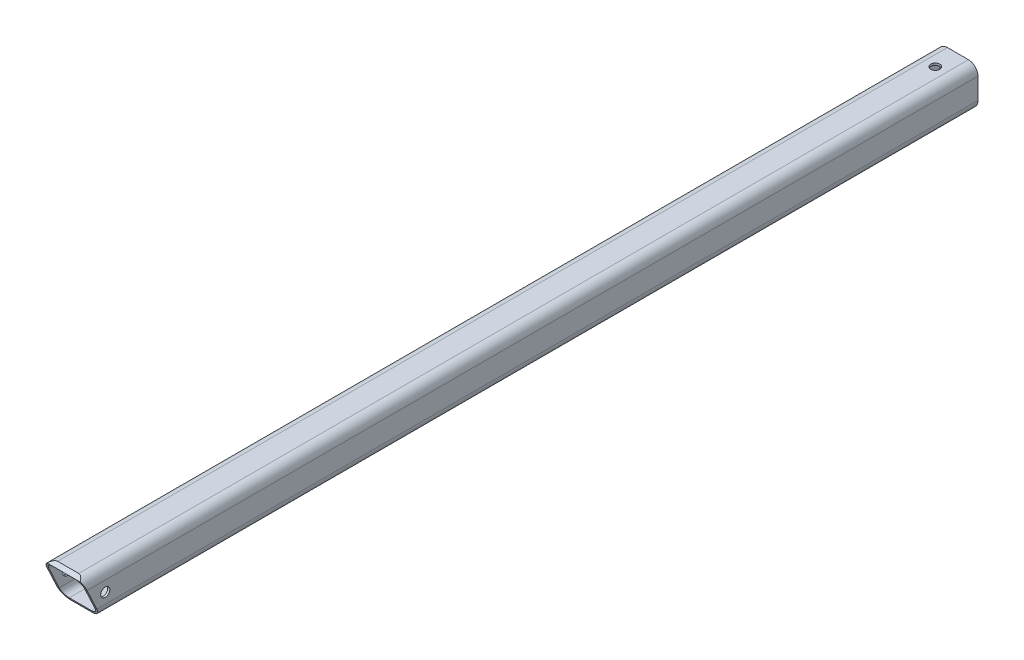
ISO-10303-21;
HEADER;
FILE_DESCRIPTION(('STEP AP214'),'2;1');
FILE_NAME('part.step','',(''),(''),'','','');
FILE_SCHEMA(('AUTOMOTIVE_DESIGN { 1 0 10303 214 1 1 1 1 }'));
ENDSEC;
DATA;
#1=APPLICATION_CONTEXT('core data for automotive mechanical design processes');
#2=APPLICATION_PROTOCOL_DEFINITION('international standard','automotive_design',2000,#1);
#3=PRODUCT_CONTEXT('',#1,'mechanical');
#4=PRODUCT('Part','Part','',(#3));
#5=PRODUCT_RELATED_PRODUCT_CATEGORY('part','',(#4));
#6=PRODUCT_DEFINITION_FORMATION('','',#4);
#7=PRODUCT_DEFINITION_CONTEXT('part definition',#1,'design');
#8=PRODUCT_DEFINITION('design','',#6,#7);
#9=PRODUCT_DEFINITION_SHAPE('','',#8);
#10=(LENGTH_UNIT() NAMED_UNIT(*) SI_UNIT(.MILLI.,.METRE.));
#11=(NAMED_UNIT(*) PLANE_ANGLE_UNIT() SI_UNIT($,.RADIAN.));
#12=(NAMED_UNIT(*) SI_UNIT($,.STERADIAN.) SOLID_ANGLE_UNIT());
#13=UNCERTAINTY_MEASURE_WITH_UNIT(LENGTH_MEASURE(1.E-05),#10,'distance_accuracy_value','');
#14=(GEOMETRIC_REPRESENTATION_CONTEXT(3) GLOBAL_UNCERTAINTY_ASSIGNED_CONTEXT((#13)) GLOBAL_UNIT_ASSIGNED_CONTEXT((#10,
#11,#12)) REPRESENTATION_CONTEXT('',''));
#15=CARTESIAN_POINT('',(0.,0.,0.));
#16=DIRECTION('',(0.,0.,1.));
#17=DIRECTION('',(1.,0.,0.));
#18=AXIS2_PLACEMENT_3D('',#15,#16,#17);
#19=CARTESIAN_POINT('',(11.2268,-11.2268,501.65));
#20=DIRECTION('',(-1.,0.,0.));
#21=DIRECTION('',(0.,0.,1.));
#22=AXIS2_PLACEMENT_3D('',#19,#20,#21);
#23=PLANE('',#22);
#24=DIRECTION('',(0.,0.,-1.));
#25=VECTOR('',#24,1.);
#26=CARTESIAN_POINT('',(11.2268,5.8928,501.65));
#27=LINE('',#26,#25);
#28=CARTESIAN_POINT('',(11.2268,5.8928,0.));
#29=VERTEX_POINT('',#28);
#30=CARTESIAN_POINT('',(11.2268,5.8928,499.162714951401));
#31=VERTEX_POINT('',#30);
#32=EDGE_CURVE('E177',#29,#31,#27,.F.);
#33=ORIENTED_EDGE('',*,*,#32,.T.);
#34=DIRECTION('',(0.,-0.906307787036653,-0.422618261740693));
#35=VECTOR('',#34,1.);
#36=CARTESIAN_POINT('',(11.2268,11.2268,501.65));
#37=LINE('',#36,#35);
#38=CARTESIAN_POINT('',(11.2268,-5.8928,493.66699941545));
#39=VERTEX_POINT('',#38);
#40=EDGE_CURVE('E202',#31,#39,#37,.T.);
#41=ORIENTED_EDGE('',*,*,#40,.T.);
#42=DIRECTION('',(0.,0.,-1.));
#43=VECTOR('',#42,1.);
#44=CARTESIAN_POINT('',(11.2268,-5.8928,501.65));
#45=LINE('',#44,#43);
#46=CARTESIAN_POINT('',(11.2268,-5.8928,0.));
#47=VERTEX_POINT('',#46);
#48=EDGE_CURVE('E173',#39,#47,#45,.T.);
#49=ORIENTED_EDGE('',*,*,#48,.T.);
#50=DIRECTION('',(0.,1.,0.));
#51=VECTOR('',#50,1.);
#52=CARTESIAN_POINT('',(11.2268,-11.2268,0.));
#53=LINE('',#52,#51);
#54=EDGE_CURVE('E255',#47,#29,#53,.T.);
#55=ORIENTED_EDGE('',*,*,#54,.T.);
#56=EDGE_LOOP('',(#33,#41,#49,#55));
#57=FACE_BOUND('',#56,.T.);
#58=CARTESIAN_POINT('',(11.2268,0.,488.95));
#59=DIRECTION('',(1.,0.,0.));
#60=DIRECTION('',(0.,0.,-1.));
#61=AXIS2_PLACEMENT_3D('',#58,#59,#60);
#62=CIRCLE('',#61,2.55269999999999);
#63=CARTESIAN_POINT('',(11.2268,0.,486.3973));
#64=VERTEX_POINT('',#63);
#65=EDGE_CURVE('E224',#64,#64,#62,.T.);
#66=ORIENTED_EDGE('',*,*,#65,.F.);
#67=EDGE_LOOP('',(#66));
#68=FACE_BOUND('',#67,.T.);
#69=ADVANCED_FACE('F34',(#57,#68),#23,.F.);
#70=CARTESIAN_POINT('',(0.,0.,0.));
#71=DIRECTION('',(0.,0.,1.));
#72=DIRECTION('',(1.,0.,0.));
#73=AXIS2_PLACEMENT_3D('',#70,#71,#72);
#74=PLANE('',#73);
#75=DIRECTION('',(1.,0.,0.));
#76=VECTOR('',#75,1.);
#77=CARTESIAN_POINT('',(11.2268,-11.2268,0.));
#78=LINE('',#77,#76);
#79=CARTESIAN_POINT('',(-5.8928,-11.2268,0.));
#80=VERTEX_POINT('',#79);
#81=CARTESIAN_POINT('',(5.8928,-11.2268,0.));
#82=VERTEX_POINT('',#81);
#83=EDGE_CURVE('E252',#80,#82,#78,.T.);
#84=ORIENTED_EDGE('',*,*,#83,.F.);
#85=CARTESIAN_POINT('',(-5.8928,-5.8928,0.));
#86=DIRECTION('',(0.,0.,1.));
#87=DIRECTION('',(1.,0.,0.));
#88=AXIS2_PLACEMENT_3D('',#85,#86,#87);
#89=CIRCLE('',#88,5.334);
#90=CARTESIAN_POINT('',(-11.2268,-5.8928,0.));
#91=VERTEX_POINT('',#90);
#92=EDGE_CURVE('E298',#80,#91,#89,.F.);
#93=ORIENTED_EDGE('',*,*,#92,.T.);
#94=DIRECTION('',(0.,-1.,0.));
#95=VECTOR('',#94,1.);
#96=CARTESIAN_POINT('',(-11.2268,-11.2268,0.));
#97=LINE('',#96,#95);
#98=CARTESIAN_POINT('',(-11.2268,5.8928,0.));
#99=VERTEX_POINT('',#98);
#100=EDGE_CURVE('E249',#99,#91,#97,.T.);
#101=ORIENTED_EDGE('',*,*,#100,.F.);
#102=CARTESIAN_POINT('',(-5.8928,5.8928,0.));
#103=DIRECTION('',(0.,0.,1.));
#104=DIRECTION('',(1.,0.,0.));
#105=AXIS2_PLACEMENT_3D('',#102,#103,#104);
#106=CIRCLE('',#105,5.334);
#107=CARTESIAN_POINT('',(-5.8928,11.2268,0.));
#108=VERTEX_POINT('',#107);
#109=EDGE_CURVE('E294',#99,#108,#106,.F.);
#110=ORIENTED_EDGE('',*,*,#109,.T.);
#111=DIRECTION('',(-1.,0.,0.));
#112=VECTOR('',#111,1.);
#113=CARTESIAN_POINT('',(11.2268,11.2268,0.));
#114=LINE('',#113,#112);
#115=CARTESIAN_POINT('',(5.8928,11.2268,0.));
#116=VERTEX_POINT('',#115);
#117=EDGE_CURVE('E258',#116,#108,#114,.T.);
#118=ORIENTED_EDGE('',*,*,#117,.F.);
#119=CARTESIAN_POINT('',(5.8928,5.8928,0.));
#120=DIRECTION('',(0.,0.,1.));
#121=DIRECTION('',(1.,0.,0.));
#122=AXIS2_PLACEMENT_3D('',#119,#120,#121);
#123=CIRCLE('',#122,5.334);
#124=EDGE_CURVE('E171',#116,#29,#123,.F.);
#125=ORIENTED_EDGE('',*,*,#124,.T.);
#126=ORIENTED_EDGE('',*,*,#54,.F.);
#127=CARTESIAN_POINT('',(5.8928,-5.8928,0.));
#128=DIRECTION('',(0.,0.,1.));
#129=DIRECTION('',(1.,0.,0.));
#130=AXIS2_PLACEMENT_3D('',#127,#128,#129);
#131=CIRCLE('',#130,5.334);
#132=EDGE_CURVE('E296',#47,#82,#131,.F.);
#133=ORIENTED_EDGE('',*,*,#132,.T.);
#134=EDGE_LOOP('',(#84,#93,#101,#110,#118,#125,#126,#133));
#135=FACE_BOUND('',#134,.T.);
#136=DIRECTION('',(-1.,0.,0.));
#137=VECTOR('',#136,1.);
#138=CARTESIAN_POINT('',(10.033,10.033,0.));
#139=LINE('',#138,#137);
#140=CARTESIAN_POINT('',(6.223,10.033,0.));
#141=VERTEX_POINT('',#140);
#142=CARTESIAN_POINT('',(-6.223,10.033,0.));
#143=VERTEX_POINT('',#142);
#144=EDGE_CURVE('E246',#141,#143,#139,.T.);
#145=ORIENTED_EDGE('',*,*,#144,.T.);
#146=CARTESIAN_POINT('',(-6.223,6.223,0.));
#147=DIRECTION('',(0.,0.,1.));
#148=DIRECTION('',(1.,0.,0.));
#149=AXIS2_PLACEMENT_3D('',#146,#147,#148);
#150=CIRCLE('',#149,3.81);
#151=CARTESIAN_POINT('',(-10.033,6.223,0.));
#152=VERTEX_POINT('',#151);
#153=EDGE_CURVE('E286',#143,#152,#150,.T.);
#154=ORIENTED_EDGE('',*,*,#153,.T.);
#155=DIRECTION('',(0.,-1.,0.));
#156=VECTOR('',#155,1.);
#157=CARTESIAN_POINT('',(-10.033,-10.033,0.));
#158=LINE('',#157,#156);
#159=CARTESIAN_POINT('',(-10.033,-6.223,0.));
#160=VERTEX_POINT('',#159);
#161=EDGE_CURVE('E237',#152,#160,#158,.T.);
#162=ORIENTED_EDGE('',*,*,#161,.T.);
#163=CARTESIAN_POINT('',(-6.223,-6.223,0.));
#164=DIRECTION('',(0.,0.,1.));
#165=DIRECTION('',(1.,0.,0.));
#166=AXIS2_PLACEMENT_3D('',#163,#164,#165);
#167=CIRCLE('',#166,3.81);
#168=CARTESIAN_POINT('',(-6.223,-10.033,0.));
#169=VERTEX_POINT('',#168);
#170=EDGE_CURVE('E280',#160,#169,#167,.T.);
#171=ORIENTED_EDGE('',*,*,#170,.T.);
#172=DIRECTION('',(1.,0.,0.));
#173=VECTOR('',#172,1.);
#174=CARTESIAN_POINT('',(10.033,-10.033,0.));
#175=LINE('',#174,#173);
#176=CARTESIAN_POINT('',(6.223,-10.033,0.));
#177=VERTEX_POINT('',#176);
#178=EDGE_CURVE('E240',#169,#177,#175,.T.);
#179=ORIENTED_EDGE('',*,*,#178,.T.);
#180=CARTESIAN_POINT('',(6.223,-6.223,0.));
#181=DIRECTION('',(0.,0.,1.));
#182=DIRECTION('',(1.,0.,0.));
#183=AXIS2_PLACEMENT_3D('',#180,#181,#182);
#184=CIRCLE('',#183,3.81);
#185=CARTESIAN_POINT('',(10.033,-6.223,0.));
#186=VERTEX_POINT('',#185);
#187=EDGE_CURVE('E282',#177,#186,#184,.T.);
#188=ORIENTED_EDGE('',*,*,#187,.T.);
#189=DIRECTION('',(0.,1.,0.));
#190=VECTOR('',#189,1.);
#191=CARTESIAN_POINT('',(10.033,-10.033,0.));
#192=LINE('',#191,#190);
#193=CARTESIAN_POINT('',(10.033,6.223,0.));
#194=VERTEX_POINT('',#193);
#195=EDGE_CURVE('E243',#186,#194,#192,.T.);
#196=ORIENTED_EDGE('',*,*,#195,.T.);
#197=CARTESIAN_POINT('',(6.223,6.223,0.));
#198=DIRECTION('',(0.,0.,1.));
#199=DIRECTION('',(1.,0.,0.));
#200=AXIS2_PLACEMENT_3D('',#197,#198,#199);
#201=CIRCLE('',#200,3.81);
#202=EDGE_CURVE('E284',#194,#141,#201,.T.);
#203=ORIENTED_EDGE('',*,*,#202,.T.);
#204=EDGE_LOOP('',(#145,#154,#162,#171,#179,#188,#196,#203));
#205=FACE_BOUND('',#204,.T.);
#206=ADVANCED_FACE('F312',(#135,#205),#74,.F.);
#207=CARTESIAN_POINT('',(-11.2268,-11.2268,501.65));
#208=DIRECTION('',(1.,0.,0.));
#209=DIRECTION('',(0.,0.,-1.));
#210=AXIS2_PLACEMENT_3D('',#207,#208,#209);
#211=PLANE('',#210);
#212=CARTESIAN_POINT('',(-11.2268,0.,488.95));
#213=DIRECTION('',(1.,0.,0.));
#214=DIRECTION('',(0.,0.,-1.));
#215=AXIS2_PLACEMENT_3D('',#212,#213,#214);
#216=CIRCLE('',#215,2.55269999999999);
#217=CARTESIAN_POINT('',(-11.2268,0.,486.3973));
#218=VERTEX_POINT('',#217);
#219=EDGE_CURVE('E184',#218,#218,#216,.T.);
#220=ORIENTED_EDGE('',*,*,#219,.T.);
#221=EDGE_LOOP('',(#220));
#222=FACE_BOUND('',#221,.T.);
#223=DIRECTION('',(0.,0.,-1.));
#224=VECTOR('',#223,1.);
#225=CARTESIAN_POINT('',(-11.2268,-5.8928,501.65));
#226=LINE('',#225,#224);
#227=CARTESIAN_POINT('',(-11.2268,-5.8928,493.66699941545));
#228=VERTEX_POINT('',#227);
#229=EDGE_CURVE('E301',#91,#228,#226,.F.);
#230=ORIENTED_EDGE('',*,*,#229,.T.);
#231=DIRECTION('',(0.,-0.906307787036653,-0.422618261740693));
#232=VECTOR('',#231,1.);
#233=CARTESIAN_POINT('',(-11.2268,11.2268,501.65));
#234=LINE('',#233,#232);
#235=CARTESIAN_POINT('',(-11.2268,5.8928,499.162714951401));
#236=VERTEX_POINT('',#235);
#237=EDGE_CURVE('E324',#236,#228,#234,.T.);
#238=ORIENTED_EDGE('',*,*,#237,.F.);
#239=DIRECTION('',(0.,0.,-1.));
#240=VECTOR('',#239,1.);
#241=CARTESIAN_POINT('',(-11.2268,5.8928,501.65));
#242=LINE('',#241,#240);
#243=EDGE_CURVE('E195',#236,#99,#242,.T.);
#244=ORIENTED_EDGE('',*,*,#243,.T.);
#245=ORIENTED_EDGE('',*,*,#100,.T.);
#246=EDGE_LOOP('',(#230,#238,#244,#245));
#247=FACE_BOUND('',#246,.T.);
#248=ADVANCED_FACE('F318',(#222,#247),#211,.F.);
#249=CARTESIAN_POINT('',(11.2268,-11.2268,501.65));
#250=DIRECTION('',(0.,1.,0.));
#251=DIRECTION('',(-1.,0.,0.));
#252=AXIS2_PLACEMENT_3D('',#249,#250,#251);
#253=PLANE('',#252);
#254=DIRECTION('',(0.,0.,-1.));
#255=VECTOR('',#254,1.);
#256=CARTESIAN_POINT('',(5.8928,-11.2268,501.65));
#257=LINE('',#256,#255);
#258=CARTESIAN_POINT('',(5.8928,-11.2268,491.179714366851));
#259=VERTEX_POINT('',#258);
#260=EDGE_CURVE('E288',#82,#259,#257,.F.);
#261=ORIENTED_EDGE('',*,*,#260,.T.);
#262=DIRECTION('',(-1.,0.,0.));
#263=VECTOR('',#262,1.);
#264=CARTESIAN_POINT('',(11.2268,-11.2268,491.179714366851));
#265=LINE('',#264,#263);
#266=CARTESIAN_POINT('',(-5.8928,-11.2268,491.179714366851));
#267=VERTEX_POINT('',#266);
#268=EDGE_CURVE('E197',#259,#267,#265,.T.);
#269=ORIENTED_EDGE('',*,*,#268,.T.);
#270=DIRECTION('',(0.,0.,-1.));
#271=VECTOR('',#270,1.);
#272=CARTESIAN_POINT('',(-5.8928,-11.2268,501.65));
#273=LINE('',#272,#271);
#274=EDGE_CURVE('E291',#267,#80,#273,.T.);
#275=ORIENTED_EDGE('',*,*,#274,.T.);
#276=ORIENTED_EDGE('',*,*,#83,.T.);
#277=EDGE_LOOP('',(#261,#269,#275,#276));
#278=FACE_BOUND('',#277,.T.);
#279=ADVANCED_FACE('F326',(#278),#253,.F.);
#280=CARTESIAN_POINT('',(11.2268,11.2268,501.65));
#281=DIRECTION('',(0.,-1.,0.));
#282=DIRECTION('',(0.,0.,-1.));
#283=AXIS2_PLACEMENT_3D('',#280,#281,#282);
#284=PLANE('',#283);
#285=CARTESIAN_POINT('',(0.,11.2268,12.7));
#286=DIRECTION('',(0.,1.,0.));
#287=DIRECTION('',(0.,0.,1.));
#288=AXIS2_PLACEMENT_3D('',#285,#286,#287);
#289=CIRCLE('',#288,2.5527);
#290=CARTESIAN_POINT('',(0.,11.2268,15.2527));
#291=VERTEX_POINT('',#290);
#292=EDGE_CURVE('E231',#291,#291,#289,.T.);
#293=ORIENTED_EDGE('',*,*,#292,.F.);
#294=EDGE_LOOP('',(#293));
#295=FACE_BOUND('',#294,.T.);
#296=DIRECTION('',(0.,0.,-1.));
#297=VECTOR('',#296,1.);
#298=CARTESIAN_POINT('',(-5.8928,11.2268,501.65));
#299=LINE('',#298,#297);
#300=CARTESIAN_POINT('',(-5.8928,11.2268,498.53320955599));
#301=VERTEX_POINT('',#300);
#302=EDGE_CURVE('E168',#108,#301,#299,.F.);
#303=ORIENTED_EDGE('',*,*,#302,.T.);
#304=DIRECTION('',(-1.,0.,0.));
#305=VECTOR('',#304,1.);
#306=CARTESIAN_POINT('',(11.2268,11.2268,498.53320955599));
#307=LINE('',#306,#305);
#308=CARTESIAN_POINT('',(5.8928,11.2268,498.53320955599));
#309=VERTEX_POINT('',#308);
#310=EDGE_CURVE('E155',#309,#301,#307,.T.);
#311=ORIENTED_EDGE('',*,*,#310,.F.);
#312=DIRECTION('',(0.,0.,-1.));
#313=VECTOR('',#312,1.);
#314=CARTESIAN_POINT('',(5.8928,11.2268,501.65));
#315=LINE('',#314,#313);
#316=EDGE_CURVE('E165',#309,#116,#315,.T.);
#317=ORIENTED_EDGE('',*,*,#316,.T.);
#318=ORIENTED_EDGE('',*,*,#117,.T.);
#319=EDGE_LOOP('',(#303,#311,#317,#318));
#320=FACE_BOUND('',#319,.T.);
#321=ADVANCED_FACE('F163',(#295,#320),#284,.F.);
#322=CARTESIAN_POINT('',(-10.033,-10.033,501.65));
#323=DIRECTION('',(1.,0.,0.));
#324=DIRECTION('',(0.,0.,-1.));
#325=AXIS2_PLACEMENT_3D('',#322,#323,#324);
#326=PLANE('',#325);
#327=DIRECTION('',(0.,0.906307787036653,0.422618261740693));
#328=VECTOR('',#327,1.);
#329=CARTESIAN_POINT('',(-10.033,-6.23586801220705,493.50702417409));
#330=LINE('',#329,#328);
#331=CARTESIAN_POINT('',(-10.033,-6.223,493.513024626727));
#332=VERTEX_POINT('',#331);
#333=CARTESIAN_POINT('',(-10.033,6.223,499.316689740124));
#334=VERTEX_POINT('',#333);
#335=EDGE_CURVE('E57',#332,#334,#330,.T.);
#336=ORIENTED_EDGE('',*,*,#335,.F.);
#337=DIRECTION('',(0.,0.,-1.));
#338=VECTOR('',#337,1.);
#339=CARTESIAN_POINT('',(-10.033,-6.223,0.));
#340=LINE('',#339,#338);
#341=EDGE_CURVE('E263',#332,#160,#340,.T.);
#342=ORIENTED_EDGE('',*,*,#341,.T.);
#343=ORIENTED_EDGE('',*,*,#161,.F.);
#344=DIRECTION('',(0.,0.,-1.));
#345=VECTOR('',#344,1.);
#346=CARTESIAN_POINT('',(-10.033,6.223,501.65));
#347=LINE('',#346,#345);
#348=EDGE_CURVE('E260',#152,#334,#347,.F.);
#349=ORIENTED_EDGE('',*,*,#348,.T.);
#350=EDGE_LOOP('',(#336,#342,#343,#349));
#351=FACE_BOUND('',#350,.T.);
#352=CARTESIAN_POINT('',(-10.033,0.,488.95));
#353=DIRECTION('',(1.,0.,0.));
#354=DIRECTION('',(0.,0.,-1.));
#355=AXIS2_PLACEMENT_3D('',#352,#353,#354);
#356=CIRCLE('',#355,2.55269999999999);
#357=CARTESIAN_POINT('',(-10.033,0.,486.3973));
#358=VERTEX_POINT('',#357);
#359=EDGE_CURVE('E183',#358,#358,#356,.T.);
#360=ORIENTED_EDGE('',*,*,#359,.F.);
#361=EDGE_LOOP('',(#360));
#362=FACE_BOUND('',#361,.T.);
#363=ADVANCED_FACE('F396',(#351,#362),#326,.T.);
#364=CARTESIAN_POINT('',(10.033,-10.033,501.65));
#365=DIRECTION('',(0.,1.,0.));
#366=DIRECTION('',(0.,0.,1.));
#367=AXIS2_PLACEMENT_3D('',#364,#365,#366);
#368=PLANE('',#367);
#369=DIRECTION('',(-1.,0.,0.));
#370=VECTOR('',#369,1.);
#371=CARTESIAN_POINT('',(10.033,-10.033,491.736392449157));
#372=LINE('',#371,#370);
#373=CARTESIAN_POINT('',(6.223,-10.033,491.736392449157));
#374=VERTEX_POINT('',#373);
#375=CARTESIAN_POINT('',(-6.223,-10.033,491.736392449157));
#376=VERTEX_POINT('',#375);
#377=EDGE_CURVE('E219',#374,#376,#372,.T.);
#378=ORIENTED_EDGE('',*,*,#377,.F.);
#379=DIRECTION('',(0.,0.,-1.));
#380=VECTOR('',#379,1.);
#381=CARTESIAN_POINT('',(6.223,-10.033,0.));
#382=LINE('',#381,#380);
#383=EDGE_CURVE('E265',#374,#177,#382,.T.);
#384=ORIENTED_EDGE('',*,*,#383,.T.);
#385=ORIENTED_EDGE('',*,*,#178,.F.);
#386=DIRECTION('',(0.,0.,-1.));
#387=VECTOR('',#386,1.);
#388=CARTESIAN_POINT('',(-6.223,-10.033,501.65));
#389=LINE('',#388,#387);
#390=EDGE_CURVE('E267',#169,#376,#389,.F.);
#391=ORIENTED_EDGE('',*,*,#390,.T.);
#392=EDGE_LOOP('',(#378,#384,#385,#391));
#393=FACE_BOUND('',#392,.T.);
#394=ADVANCED_FACE('F390',(#393),#368,.T.);
#395=CARTESIAN_POINT('',(10.033,-10.033,501.65));
#396=DIRECTION('',(-1.,0.,0.));
#397=DIRECTION('',(0.,0.,1.));
#398=AXIS2_PLACEMENT_3D('',#395,#396,#397);
#399=PLANE('',#398);
#400=DIRECTION('',(0.,-0.906307787036653,-0.422618261740693));
#401=VECTOR('',#400,1.);
#402=CARTESIAN_POINT('',(10.033,-6.23586801220705,493.50702417409));
#403=LINE('',#402,#401);
#404=CARTESIAN_POINT('',(10.033,6.223,499.316689740124));
#405=VERTEX_POINT('',#404);
#406=CARTESIAN_POINT('',(10.033,-6.223,493.513024626727));
#407=VERTEX_POINT('',#406);
#408=EDGE_CURVE('E217',#405,#407,#403,.T.);
#409=ORIENTED_EDGE('',*,*,#408,.F.);
#410=DIRECTION('',(0.,0.,-1.));
#411=VECTOR('',#410,1.);
#412=CARTESIAN_POINT('',(10.033,6.223,0.));
#413=LINE('',#412,#411);
#414=EDGE_CURVE('E270',#405,#194,#413,.T.);
#415=ORIENTED_EDGE('',*,*,#414,.T.);
#416=ORIENTED_EDGE('',*,*,#195,.F.);
#417=DIRECTION('',(0.,0.,-1.));
#418=VECTOR('',#417,1.);
#419=CARTESIAN_POINT('',(10.033,-6.223,501.65));
#420=LINE('',#419,#418);
#421=EDGE_CURVE('E272',#186,#407,#420,.F.);
#422=ORIENTED_EDGE('',*,*,#421,.T.);
#423=EDGE_LOOP('',(#409,#415,#416,#422));
#424=FACE_BOUND('',#423,.T.);
#425=CARTESIAN_POINT('',(10.033,0.,488.95));
#426=DIRECTION('',(-1.,0.,0.));
#427=DIRECTION('',(0.,0.,1.));
#428=AXIS2_PLACEMENT_3D('',#425,#426,#427);
#429=CIRCLE('',#428,2.55269999999999);
#430=CARTESIAN_POINT('',(10.033,0.,491.5027));
#431=VERTEX_POINT('',#430);
#432=EDGE_CURVE('E181',#431,#431,#429,.T.);
#433=ORIENTED_EDGE('',*,*,#432,.F.);
#434=EDGE_LOOP('',(#433));
#435=FACE_BOUND('',#434,.T.);
#436=ADVANCED_FACE('F382',(#424,#435),#399,.T.);
#437=CARTESIAN_POINT('',(10.033,10.033,501.65));
#438=DIRECTION('',(0.,-1.,0.));
#439=DIRECTION('',(0.,0.,-1.));
#440=AXIS2_PLACEMENT_3D('',#437,#438,#439);
#441=PLANE('',#440);
#442=DIRECTION('',(1.,0.,0.));
#443=VECTOR('',#442,1.);
#444=CARTESIAN_POINT('',(10.033,10.033,501.093321917695));
#445=LINE('',#444,#443);
#446=CARTESIAN_POINT('',(-6.223,10.033,501.093321917695));
#447=VERTEX_POINT('',#446);
#448=CARTESIAN_POINT('',(6.223,10.033,501.093321917695));
#449=VERTEX_POINT('',#448);
#450=EDGE_CURVE('E208',#447,#449,#445,.T.);
#451=ORIENTED_EDGE('',*,*,#450,.F.);
#452=DIRECTION('',(0.,0.,-1.));
#453=VECTOR('',#452,1.);
#454=CARTESIAN_POINT('',(-6.223,10.033,0.));
#455=LINE('',#454,#453);
#456=EDGE_CURVE('E275',#447,#143,#455,.T.);
#457=ORIENTED_EDGE('',*,*,#456,.T.);
#458=ORIENTED_EDGE('',*,*,#144,.F.);
#459=DIRECTION('',(0.,0.,-1.));
#460=VECTOR('',#459,1.);
#461=CARTESIAN_POINT('',(6.223,10.033,501.65));
#462=LINE('',#461,#460);
#463=EDGE_CURVE('E277',#141,#449,#462,.F.);
#464=ORIENTED_EDGE('',*,*,#463,.T.);
#465=EDGE_LOOP('',(#451,#457,#458,#464));
#466=FACE_BOUND('',#465,.T.);
#467=CARTESIAN_POINT('',(0.,10.033,12.7));
#468=DIRECTION('',(0.,-1.,0.));
#469=DIRECTION('',(0.,0.,-1.));
#470=AXIS2_PLACEMENT_3D('',#467,#468,#469);
#471=CIRCLE('',#470,2.5527);
#472=CARTESIAN_POINT('',(0.,10.033,10.1473));
#473=VERTEX_POINT('',#472);
#474=EDGE_CURVE('E234',#473,#473,#471,.T.);
#475=ORIENTED_EDGE('',*,*,#474,.F.);
#476=EDGE_LOOP('',(#475));
#477=FACE_BOUND('',#476,.T.);
#478=ADVANCED_FACE('F357',(#466,#477),#441,.T.);
#479=CARTESIAN_POINT('',(-6.223,-6.223,501.65));
#480=DIRECTION('',(0.,0.,1.));
#481=DIRECTION('',(1.,0.,0.));
#482=AXIS2_PLACEMENT_3D('',#479,#480,#481);
#483=CYLINDRICAL_SURFACE('',#482,3.81);
#484=ORIENTED_EDGE('',*,*,#341,.F.);
#485=CARTESIAN_POINT('',(-6.223,-6.223,493.513024626727));
#486=DIRECTION('',(0.,0.422618261740693,-0.906307787036653));
#487=DIRECTION('',(0.,0.906307787036653,0.422618261740693));
#488=AXIS2_PLACEMENT_3D('',#485,#486,#487);
#489=ELLIPSE('',#488,4.20386987124708,3.81);
#490=EDGE_CURVE('E214',#332,#376,#489,.F.);
#491=ORIENTED_EDGE('',*,*,#490,.T.);
#492=ORIENTED_EDGE('',*,*,#390,.F.);
#493=ORIENTED_EDGE('',*,*,#170,.F.);
#494=EDGE_LOOP('',(#484,#491,#492,#493));
#495=FACE_BOUND('',#494,.T.);
#496=ADVANCED_FACE('F353',(#495),#483,.F.);
#497=CARTESIAN_POINT('',(6.223,-6.223,501.65));
#498=DIRECTION('',(0.,0.,1.));
#499=DIRECTION('',(1.,0.,0.));
#500=AXIS2_PLACEMENT_3D('',#497,#498,#499);
#501=CYLINDRICAL_SURFACE('',#500,3.81);
#502=ORIENTED_EDGE('',*,*,#383,.F.);
#503=CARTESIAN_POINT('',(6.223,-6.223,493.513024626727));
#504=DIRECTION('',(0.,0.422618261740693,-0.906307787036653));
#505=DIRECTION('',(0.,0.906307787036653,0.422618261740693));
#506=AXIS2_PLACEMENT_3D('',#503,#504,#505);
#507=ELLIPSE('',#506,4.20386987124708,3.81);
#508=EDGE_CURVE('E221',#374,#407,#507,.F.);
#509=ORIENTED_EDGE('',*,*,#508,.T.);
#510=ORIENTED_EDGE('',*,*,#421,.F.);
#511=ORIENTED_EDGE('',*,*,#187,.F.);
#512=EDGE_LOOP('',(#502,#509,#510,#511));
#513=FACE_BOUND('',#512,.T.);
#514=ADVANCED_FACE('F356',(#513),#501,.F.);
#515=CARTESIAN_POINT('',(6.223,6.223,501.65));
#516=DIRECTION('',(0.,0.,1.));
#517=DIRECTION('',(1.,0.,0.));
#518=AXIS2_PLACEMENT_3D('',#515,#516,#517);
#519=CYLINDRICAL_SURFACE('',#518,3.81);
#520=ORIENTED_EDGE('',*,*,#414,.F.);
#521=CARTESIAN_POINT('',(6.223,6.223,499.316689740124));
#522=DIRECTION('',(0.,0.422618261740693,-0.906307787036653));
#523=DIRECTION('',(0.,0.906307787036653,0.422618261740693));
#524=AXIS2_PLACEMENT_3D('',#521,#522,#523);
#525=ELLIPSE('',#524,4.20386987124708,3.81);
#526=EDGE_CURVE('E211',#405,#449,#525,.F.);
#527=ORIENTED_EDGE('',*,*,#526,.T.);
#528=ORIENTED_EDGE('',*,*,#463,.F.);
#529=ORIENTED_EDGE('',*,*,#202,.F.);
#530=EDGE_LOOP('',(#520,#527,#528,#529));
#531=FACE_BOUND('',#530,.T.);
#532=ADVANCED_FACE('F361',(#531),#519,.F.);
#533=CARTESIAN_POINT('',(-6.223,6.223,501.65));
#534=DIRECTION('',(0.,0.,1.));
#535=DIRECTION('',(1.,0.,0.));
#536=AXIS2_PLACEMENT_3D('',#533,#534,#535);
#537=CYLINDRICAL_SURFACE('',#536,3.81);
#538=ORIENTED_EDGE('',*,*,#456,.F.);
#539=CARTESIAN_POINT('',(-6.223,6.223,499.316689740124));
#540=DIRECTION('',(0.,0.422618261740693,-0.906307787036653));
#541=DIRECTION('',(0.,0.906307787036653,0.422618261740693));
#542=AXIS2_PLACEMENT_3D('',#539,#540,#541);
#543=ELLIPSE('',#542,4.20386987124708,3.81);
#544=EDGE_CURVE('E189',#447,#334,#543,.F.);
#545=ORIENTED_EDGE('',*,*,#544,.T.);
#546=ORIENTED_EDGE('',*,*,#348,.F.);
#547=ORIENTED_EDGE('',*,*,#153,.F.);
#548=EDGE_LOOP('',(#538,#545,#546,#547));
#549=FACE_BOUND('',#548,.T.);
#550=ADVANCED_FACE('F338',(#549),#537,.F.);
#551=CARTESIAN_POINT('',(-5.8928,-5.8928,501.65));
#552=DIRECTION('',(0.,0.,-1.));
#553=DIRECTION('',(-1.,0.,0.));
#554=AXIS2_PLACEMENT_3D('',#551,#552,#553);
#555=CYLINDRICAL_SURFACE('',#554,5.334);
#556=CARTESIAN_POINT('',(-5.8928,-5.8928,493.66699941545));
#557=DIRECTION('',(0.,0.422618261740693,-0.906307787036653));
#558=DIRECTION('',(0.,-0.906307787036653,-0.422618261740693));
#559=AXIS2_PLACEMENT_3D('',#556,#557,#558);
#560=ELLIPSE('',#559,5.88541781974591,5.334);
#561=EDGE_CURVE('E199',#228,#267,#560,.F.);
#562=ORIENTED_EDGE('',*,*,#561,.F.);
#563=ORIENTED_EDGE('',*,*,#229,.F.);
#564=ORIENTED_EDGE('',*,*,#92,.F.);
#565=ORIENTED_EDGE('',*,*,#274,.F.);
#566=EDGE_LOOP('',(#562,#563,#564,#565));
#567=FACE_BOUND('',#566,.T.);
#568=ADVANCED_FACE('F321',(#567),#555,.T.);
#569=CARTESIAN_POINT('',(5.8928,-5.8928,501.65));
#570=DIRECTION('',(0.,0.,-1.));
#571=DIRECTION('',(-1.,0.,0.));
#572=AXIS2_PLACEMENT_3D('',#569,#570,#571);
#573=CYLINDRICAL_SURFACE('',#572,5.334);
#574=CARTESIAN_POINT('',(5.8928,-5.8928,493.66699941545));
#575=DIRECTION('',(0.,0.422618261740693,-0.906307787036653));
#576=DIRECTION('',(0.,-0.906307787036653,-0.422618261740693));
#577=AXIS2_PLACEMENT_3D('',#574,#575,#576);
#578=ELLIPSE('',#577,5.88541781974591,5.334);
#579=EDGE_CURVE('E196',#259,#39,#578,.F.);
#580=ORIENTED_EDGE('',*,*,#579,.F.);
#581=ORIENTED_EDGE('',*,*,#260,.F.);
#582=ORIENTED_EDGE('',*,*,#132,.F.);
#583=ORIENTED_EDGE('',*,*,#48,.F.);
#584=EDGE_LOOP('',(#580,#581,#582,#583));
#585=FACE_BOUND('',#584,.T.);
#586=ADVANCED_FACE('F329',(#585),#573,.T.);
#587=CARTESIAN_POINT('',(-5.8928,5.8928,501.65));
#588=DIRECTION('',(0.,0.,-1.));
#589=DIRECTION('',(-1.,0.,0.));
#590=AXIS2_PLACEMENT_3D('',#587,#588,#589);
#591=CYLINDRICAL_SURFACE('',#590,5.334);
#592=CARTESIAN_POINT('',(-5.8928,5.8928,509.972009469989));
#593=DIRECTION('',(0.,-0.906307787036658,-0.422618261740682));
#594=DIRECTION('',(0.,0.422618261740682,-0.906307787036658));
#595=AXIS2_PLACEMENT_3D('',#592,#593,#594);
#596=ELLIPSE('',#595,12.6213192445359,5.334);
#597=CARTESIAN_POINT('',(-9.25587894049484,10.033,501.093321917695));
#598=VERTEX_POINT('',#597);
#599=EDGE_CURVE('E49',#301,#598,#596,.F.);
#600=ORIENTED_EDGE('',*,*,#599,.F.);
#601=ORIENTED_EDGE('',*,*,#302,.F.);
#602=ORIENTED_EDGE('',*,*,#109,.F.);
#603=ORIENTED_EDGE('',*,*,#243,.F.);
#604=CARTESIAN_POINT('',(-5.8928,5.8928,499.162714951401));
#605=DIRECTION('',(0.,0.422618261740693,-0.906307787036653));
#606=DIRECTION('',(0.,-0.906307787036653,-0.422618261740693));
#607=AXIS2_PLACEMENT_3D('',#604,#605,#606);
#608=ELLIPSE('',#607,5.88541781974591,5.334);
#609=EDGE_CURVE('E187',#598,#236,#608,.F.);
#610=ORIENTED_EDGE('',*,*,#609,.F.);
#611=EDGE_LOOP('',(#600,#601,#602,#603,#610));
#612=FACE_BOUND('',#611,.T.);
#613=ADVANCED_FACE('F193',(#612),#591,.T.);
#614=CARTESIAN_POINT('',(5.8928,5.8928,501.65));
#615=DIRECTION('',(0.,0.,-1.));
#616=DIRECTION('',(-1.,0.,0.));
#617=AXIS2_PLACEMENT_3D('',#614,#615,#616);
#618=CYLINDRICAL_SURFACE('',#617,5.334);
#619=CARTESIAN_POINT('',(5.8928,5.8928,509.972009469989));
#620=DIRECTION('',(0.,-0.906307787036658,-0.422618261740682));
#621=DIRECTION('',(0.,0.422618261740682,-0.906307787036658));
#622=AXIS2_PLACEMENT_3D('',#619,#620,#621);
#623=ELLIPSE('',#622,12.6213192445359,5.334);
#624=CARTESIAN_POINT('',(9.25587894049484,10.033,501.093321917695));
#625=VERTEX_POINT('',#624);
#626=EDGE_CURVE('E152',#625,#309,#623,.F.);
#627=ORIENTED_EDGE('',*,*,#626,.F.);
#628=CARTESIAN_POINT('',(5.8928,5.8928,499.162714951401));
#629=DIRECTION('',(0.,0.422618261740693,-0.906307787036653));
#630=DIRECTION('',(0.,-0.906307787036653,-0.422618261740693));
#631=AXIS2_PLACEMENT_3D('',#628,#629,#630);
#632=ELLIPSE('',#631,5.88541781974591,5.334);
#633=EDGE_CURVE('E175',#31,#625,#632,.F.);
#634=ORIENTED_EDGE('',*,*,#633,.F.);
#635=ORIENTED_EDGE('',*,*,#32,.F.);
#636=ORIENTED_EDGE('',*,*,#124,.F.);
#637=ORIENTED_EDGE('',*,*,#316,.F.);
#638=EDGE_LOOP('',(#627,#634,#635,#636,#637));
#639=FACE_BOUND('',#638,.T.);
#640=ADVANCED_FACE('F36',(#639),#618,.T.);
#641=CARTESIAN_POINT('',(0.,11.2268,12.7));
#642=DIRECTION('',(0.,1.,0.));
#643=DIRECTION('',(0.,0.,1.));
#644=AXIS2_PLACEMENT_3D('',#641,#642,#643);
#645=CYLINDRICAL_SURFACE('',#644,2.5527);
#646=ORIENTED_EDGE('',*,*,#474,.T.);
#647=EDGE_LOOP('',(#646));
#648=FACE_BOUND('',#647,.T.);
#649=ORIENTED_EDGE('',*,*,#292,.T.);
#650=EDGE_LOOP('',(#649));
#651=FACE_BOUND('',#650,.T.);
#652=ADVANCED_FACE('F413',(#648,#651),#645,.F.);
#653=CARTESIAN_POINT('',(11.2268,0.,488.95));
#654=DIRECTION('',(1.,0.,0.));
#655=DIRECTION('',(0.,0.,-1.));
#656=AXIS2_PLACEMENT_3D('',#653,#654,#655);
#657=CYLINDRICAL_SURFACE('',#656,2.55269999999999);
#658=ORIENTED_EDGE('',*,*,#432,.T.);
#659=EDGE_LOOP('',(#658));
#660=FACE_BOUND('',#659,.T.);
#661=ORIENTED_EDGE('',*,*,#65,.T.);
#662=EDGE_LOOP('',(#661));
#663=FACE_BOUND('',#662,.T.);
#664=ADVANCED_FACE('F405',(#660,#663),#657,.F.);
#665=ORIENTED_EDGE('',*,*,#359,.T.);
#666=EDGE_LOOP('',(#665));
#667=FACE_BOUND('',#666,.T.);
#668=ORIENTED_EDGE('',*,*,#219,.F.);
#669=EDGE_LOOP('',(#668));
#670=FACE_BOUND('',#669,.T.);
#671=ADVANCED_FACE('F402',(#667,#670),#657,.F.);
#672=CARTESIAN_POINT('',(11.2268,11.2268,501.65));
#673=DIRECTION('',(0.,0.422618261740693,-0.906307787036653));
#674=DIRECTION('',(0.,0.906307787036653,0.422618261740693));
#675=AXIS2_PLACEMENT_3D('',#672,#673,#674);
#676=PLANE('',#675);
#677=ORIENTED_EDGE('',*,*,#633,.T.);
#678=DIRECTION('',(-1.,0.,0.));
#679=VECTOR('',#678,1.);
#680=CARTESIAN_POINT('',(11.2268,10.033,501.093321917695));
#681=LINE('',#680,#679);
#682=EDGE_CURVE('E11',#625,#449,#681,.T.);
#683=ORIENTED_EDGE('',*,*,#682,.T.);
#684=ORIENTED_EDGE('',*,*,#526,.F.);
#685=ORIENTED_EDGE('',*,*,#408,.T.);
#686=ORIENTED_EDGE('',*,*,#508,.F.);
#687=ORIENTED_EDGE('',*,*,#377,.T.);
#688=ORIENTED_EDGE('',*,*,#490,.F.);
#689=ORIENTED_EDGE('',*,*,#335,.T.);
#690=ORIENTED_EDGE('',*,*,#544,.F.);
#691=EDGE_CURVE('E38',#447,#598,#681,.T.);
#692=ORIENTED_EDGE('',*,*,#691,.T.);
#693=ORIENTED_EDGE('',*,*,#609,.T.);
#694=ORIENTED_EDGE('',*,*,#237,.T.);
#695=ORIENTED_EDGE('',*,*,#561,.T.);
#696=ORIENTED_EDGE('',*,*,#268,.F.);
#697=ORIENTED_EDGE('',*,*,#579,.T.);
#698=ORIENTED_EDGE('',*,*,#40,.F.);
#699=EDGE_LOOP('',(#677,#683,#684,#685,#686,#687,#688,#689,#690,#692,#693,#694,#695,#696,#697,#698));
#700=FACE_BOUND('',#699,.T.);
#701=ADVANCED_FACE('F186',(#700),#676,.F.);
#702=CARTESIAN_POINT('',(11.2268,10.033,501.093321917695));
#703=DIRECTION('',(0.,-0.906307787036658,-0.422618261740682));
#704=DIRECTION('',(0.,0.422618261740682,-0.906307787036658));
#705=AXIS2_PLACEMENT_3D('',#702,#703,#704);
#706=PLANE('',#705);
#707=ORIENTED_EDGE('',*,*,#599,.T.);
#708=ORIENTED_EDGE('',*,*,#691,.F.);
#709=ORIENTED_EDGE('',*,*,#450,.T.);
#710=ORIENTED_EDGE('',*,*,#682,.F.);
#711=ORIENTED_EDGE('',*,*,#626,.T.);
#712=ORIENTED_EDGE('',*,*,#310,.T.);
#713=EDGE_LOOP('',(#707,#708,#709,#710,#711,#712));
#714=FACE_BOUND('',#713,.T.);
#715=ADVANCED_FACE('F154',(#714),#706,.F.);
#716=CLOSED_SHELL('',(#69,#206,#248,#279,#321,#363,#394,#436,#478,#496,#514,#532,#550,#568,#586,
#613,#640,#652,#664,#671,#701,#715));
#717=MANIFOLD_SOLID_BREP('B2',#716);
#718=ADVANCED_BREP_SHAPE_REPRESENTATION('',(#18,#717),#14);
#719=SHAPE_DEFINITION_REPRESENTATION(#9,#718);
ENDSEC;
END-ISO-10303-21;
